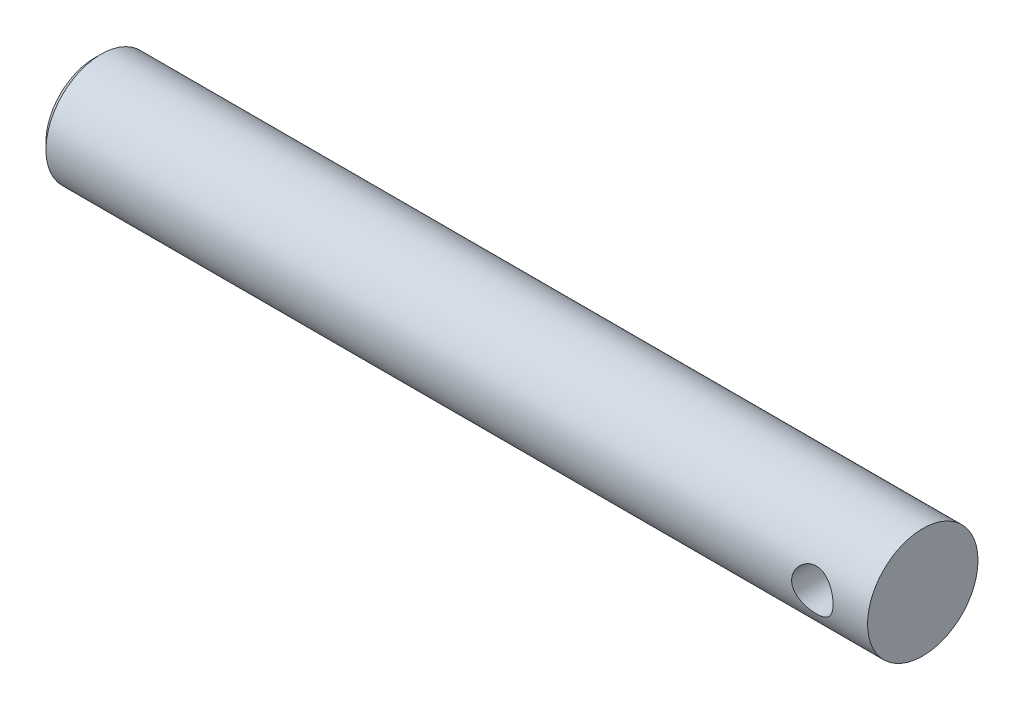
ISO-10303-21;
HEADER;
FILE_DESCRIPTION(('STEP AP214'),'2;1');
FILE_NAME('part.step','',(''),(''),'','','');
FILE_SCHEMA(('AUTOMOTIVE_DESIGN { 1 0 10303 214 1 1 1 1 }'));
ENDSEC;
DATA;
#1=APPLICATION_CONTEXT('core data for automotive mechanical design processes');
#2=APPLICATION_PROTOCOL_DEFINITION('international standard','automotive_design',2000,#1);
#3=PRODUCT_CONTEXT('',#1,'mechanical');
#4=PRODUCT('Part','Part','',(#3));
#5=PRODUCT_RELATED_PRODUCT_CATEGORY('part','',(#4));
#6=PRODUCT_DEFINITION_FORMATION('','',#4);
#7=PRODUCT_DEFINITION_CONTEXT('part definition',#1,'design');
#8=PRODUCT_DEFINITION('design','',#6,#7);
#9=PRODUCT_DEFINITION_SHAPE('','',#8);
#10=(LENGTH_UNIT() NAMED_UNIT(*) SI_UNIT(.MILLI.,.METRE.));
#11=(NAMED_UNIT(*) PLANE_ANGLE_UNIT() SI_UNIT($,.RADIAN.));
#12=(NAMED_UNIT(*) SI_UNIT($,.STERADIAN.) SOLID_ANGLE_UNIT());
#13=UNCERTAINTY_MEASURE_WITH_UNIT(LENGTH_MEASURE(1.E-05),#10,'distance_accuracy_value','');
#14=(GEOMETRIC_REPRESENTATION_CONTEXT(3) GLOBAL_UNCERTAINTY_ASSIGNED_CONTEXT((#13)) GLOBAL_UNIT_ASSIGNED_CONTEXT((#10,
#11,#12)) REPRESENTATION_CONTEXT('',''));
#15=CARTESIAN_POINT('',(0.,0.,0.));
#16=DIRECTION('',(0.,0.,1.));
#17=DIRECTION('',(1.,0.,0.));
#18=AXIS2_PLACEMENT_3D('',#15,#16,#17);
#19=CARTESIAN_POINT('',(95.25,0.,0.));
#20=DIRECTION('',(-1.,0.,0.));
#21=DIRECTION('',(0.,0.,1.));
#22=AXIS2_PLACEMENT_3D('',#19,#20,#21);
#23=CYLINDRICAL_SURFACE('',#22,6.35);
#24=CARTESIAN_POINT('',(0.762000000000013,0.,0.));
#25=DIRECTION('',(1.,0.,0.));
#26=DIRECTION('',(0.,0.,-1.));
#27=AXIS2_PLACEMENT_3D('',#24,#25,#26);
#28=CIRCLE('',#27,6.35);
#29=CARTESIAN_POINT('',(0.762000000000013,0.,-6.35));
#30=VERTEX_POINT('',#29);
#31=EDGE_CURVE('E50',#30,#30,#28,.T.);
#32=ORIENTED_EDGE('',*,*,#31,.T.);
#33=EDGE_LOOP('',(#32));
#34=FACE_BOUND('',#33,.T.);
#35=CARTESIAN_POINT('',(91.28125,0.,-6.35));
#36=CARTESIAN_POINT('',(91.2812546074062,0.128960656063842,-6.3500034521164));
#37=CARTESIAN_POINT('',(91.2707411306057,0.257889758828596,-6.34603727112054));
#38=CARTESIAN_POINT('',(91.229135240009,0.511894855609375,-6.33061179910997));
#39=CARTESIAN_POINT('',(91.198045790503,0.636971401930343,-6.31915358744214));
#40=CARTESIAN_POINT('',(91.1165421096873,0.879571496173019,-6.28997396421577));
#41=CARTESIAN_POINT('',(91.0661651545454,0.997109105857609,-6.27226463904736));
#42=CARTESIAN_POINT('',(90.9477060693374,1.2220564048794,-6.23234668827498));
#43=CARTESIAN_POINT('',(90.8796191904487,1.32946336719488,-6.21013685623732));
#44=CARTESIAN_POINT('',(90.7246526069249,1.53566243706025,-6.16245667066806));
#45=CARTESIAN_POINT('',(90.6371532086632,1.63396728411503,-6.1368940410141));
#46=CARTESIAN_POINT('',(90.4471609349791,1.81490019090553,-6.08584350633231));
#47=CARTESIAN_POINT('',(90.3446634872105,1.89752345220235,-6.06035562651864));
#48=CARTESIAN_POINT('',(90.1228235203069,2.04784646017877,-6.01126672105648));
#49=CARTESIAN_POINT('',(90.0029880681085,2.11485786698269,-5.98777455003049));
#50=CARTESIAN_POINT('',(89.7527282377575,2.2275585105536,-5.94677278126925));
#51=CARTESIAN_POINT('',(89.6223081134913,2.27325626375968,-5.92926079474211));
#52=CARTESIAN_POINT('',(89.3601896748401,2.3401088424036,-5.90318880358315));
#53=CARTESIAN_POINT('',(89.2287632514837,2.36219354234461,-5.89429104906955));
#54=CARTESIAN_POINT('',(88.9637918491848,2.38410045993992,-5.88546672569678));
#55=CARTESIAN_POINT('',(88.8302477679743,2.38393187174176,-5.88553645184146));
#56=CARTESIAN_POINT('',(88.5733408787244,2.36204807005904,-5.89434799715886));
#57=CARTESIAN_POINT('',(88.4498470616549,2.34162296008043,-5.90257056832905));
#58=CARTESIAN_POINT('',(88.2081878987316,2.28193866490974,-5.92589839169503));
#59=CARTESIAN_POINT('',(88.0900233582505,2.24267664340423,-5.94100468036945));
#60=CARTESIAN_POINT('',(87.8597476549814,2.14572450857897,-5.97671052227027));
#61=CARTESIAN_POINT('',(87.7477933157824,2.08769979870147,-5.99740859806213));
#62=CARTESIAN_POINT('',(87.5348361415743,1.95510267098283,-6.04193308596169));
#63=CARTESIAN_POINT('',(87.4338371056875,1.88052453982124,-6.06576057700738));
#64=CARTESIAN_POINT('',(87.2385166839542,1.71103576966898,-6.11581261688841));
#65=CARTESIAN_POINT('',(87.1451002828124,1.61509549213168,-6.14209064085877));
#66=CARTESIAN_POINT('',(86.9754134786483,1.4086087379252,-6.19270618460486));
#67=CARTESIAN_POINT('',(86.8991457108135,1.29806002055207,-6.21704340577199));
#68=CARTESIAN_POINT('',(86.7649229946633,1.06318595622547,-6.26151901759414));
#69=CARTESIAN_POINT('',(86.7072694648116,0.938674008228491,-6.2815866598714));
#70=CARTESIAN_POINT('',(86.6140276157213,0.680778500207775,-6.31473715344052));
#71=CARTESIAN_POINT('',(86.5784294962092,0.547398909717654,-6.3278231066712));
#72=CARTESIAN_POINT('',(86.5320488247772,0.283170698498504,-6.34499053624553));
#73=CARTESIAN_POINT('',(86.5200476123678,0.152564496055005,-6.34951373328277));
#74=CARTESIAN_POINT('',(86.5176529360589,-0.108858804467353,-6.3504110624895));
#75=CARTESIAN_POINT('',(86.5272546814971,-0.239675849361106,-6.34678700139145));
#76=CARTESIAN_POINT('',(86.566867192165,-0.492541002091955,-6.33208839264071));
#77=CARTESIAN_POINT('',(86.5960795756826,-0.614732908211651,-6.32130547652659));
#78=CARTESIAN_POINT('',(86.6730328901689,-0.852395035994594,-6.29366719883101));
#79=CARTESIAN_POINT('',(86.7207762309925,-0.967864381176714,-6.27681104747723));
#80=CARTESIAN_POINT('',(86.8349584297477,-1.19260582711238,-6.23807528747194));
#81=CARTESIAN_POINT('',(86.9019053951421,-1.30159614514801,-6.2160626283234));
#82=CARTESIAN_POINT('',(87.0520199887848,-1.50716092986602,-6.16944841108904));
#83=CARTESIAN_POINT('',(87.1351936054154,-1.60373079092935,-6.14484589877607));
#84=CARTESIAN_POINT('',(87.3210790438723,-1.78757389300697,-6.09398910566946));
#85=CARTESIAN_POINT('',(87.4246444651517,-1.87398269671165,-6.0677218069967));
#86=CARTESIAN_POINT('',(87.6453215732234,-2.02836541925647,-6.0178761999813));
#87=CARTESIAN_POINT('',(87.7624344750793,-2.09633768270549,-5.99429813321109));
#88=CARTESIAN_POINT('',(88.0078503790011,-2.2119871546141,-5.9525984234316));
#89=CARTESIAN_POINT('',(88.1361977841328,-2.25957900646984,-5.93449982021483));
#90=CARTESIAN_POINT('',(88.3999529998544,-2.33216265003688,-5.9063577721447));
#91=CARTESIAN_POINT('',(88.5353563874645,-2.35716842360038,-5.89630934428766));
#92=CARTESIAN_POINT('',(88.8000131532715,-2.3826207601782,-5.8860673298321));
#93=CARTESIAN_POINT('',(88.9291030528506,-2.38454138749642,-5.88528230680804));
#94=CARTESIAN_POINT('',(89.1856631895884,-2.36754536081029,-5.89213980233151));
#95=CARTESIAN_POINT('',(89.3131335791662,-2.34863068262072,-5.89978152177002));
#96=CARTESIAN_POINT('',(89.5588874724126,-2.29164857313009,-5.92213924766874));
#97=CARTESIAN_POINT('',(89.6773326246645,-2.25418329827482,-5.93663223035452));
#98=CARTESIAN_POINT('',(89.9063249947349,-2.16169393638122,-5.97092957922828));
#99=CARTESIAN_POINT('',(90.0168702073114,-2.106665410501,-5.99073528792403));
#100=CARTESIAN_POINT('',(90.233225028645,-1.97726420551819,-6.03471811697544));
#101=CARTESIAN_POINT('',(90.3384826399199,-1.90202872074779,-6.0590699627503));
#102=CARTESIAN_POINT('',(90.5353497280418,-1.73568496096226,-6.10879916727019));
#103=CARTESIAN_POINT('',(90.626954849974,-1.64457164120333,-6.13417684997243));
#104=CARTESIAN_POINT('',(90.7989706048672,-1.44316512989559,-6.18474799068186));
#105=CARTESIAN_POINT('',(90.8785072085776,-1.33210084768812,-6.20985716529773));
#106=CARTESIAN_POINT('',(91.0177609652515,-1.0973009918313,-6.25561541700536));
#107=CARTESIAN_POINT('',(91.0774765755315,-0.973564432868858,-6.2762641468935));
#108=CARTESIAN_POINT('',(91.1770732161142,-0.711198542678667,-6.31149189513105));
#109=CARTESIAN_POINT('',(91.2159832150555,-0.572156307796804,-6.3257693073889));
#110=CARTESIAN_POINT('',(91.2680625738741,-0.288727727100132,-6.34501909460094));
#111=CARTESIAN_POINT('',(91.2812448429861,-0.144344098479214,-6.34999613608798));
#112=CARTESIAN_POINT('',(91.28125,0.,-6.35));
#113=B_SPLINE_CURVE_WITH_KNOTS('',3,(#35,#36,#37,#38,#39,#40,#41,#42,#43,#44,#45,#46,#47,#48,
#49,#50,#51,#52,#53,#54,#55,#56,#57,#58,#59,#60,#61,#62,#63,#64,#65,#66,#67,#68,#69,#70,#71,#72,
#73,#74,#75,#76,#77,#78,#79,#80,#81,#82,#83,#84,#85,#86,#87,#88,#89,#90,#91,#92,#93,#94,#95,#96,
#97,#98,#99,#100,#101,#102,#103,#104,#105,#106,#107,#108,#109,#110,#111,#112),.UNSPECIFIED.,.T.,
.F.,(4,2,2,2,2,2,2,2,2,2,2,2,2,2,2,2,2,2,2,2,2,2,2,2,2,2,2,2,2,2,2,2,2,2,2,2,2,2,4),(0.,
0.38634955997739,0.772643472379607,1.15819454862654,1.54384911513007,1.94426869500062,
2.34481060319426,2.76060970771384,3.17624252596513,3.57482575636833,3.97324430901536,
4.34781872877956,4.72244956671187,5.10416823314393,5.4860188530651,5.89353268420603,
6.30110909424294,6.71498808266646,7.12868303271919,7.52038468672033,7.91199948569953,
8.28856670204098,8.66518290541447,9.05286514702116,9.44069073281542,9.85101724635859,
10.2613805903573,10.6734461842944,11.0852565149346,11.470620370249,11.8559476846038,
12.2295148860212,12.6031765756721,12.9964254911628,13.3897995792034,13.8044607332579,
14.219154153156,14.6518076761337,15.0842440535135),.UNSPECIFIED.);
#114=CARTESIAN_POINT('',(91.28125,0.,-6.35));
#115=VERTEX_POINT('',#114);
#116=EDGE_CURVE('E54',#115,#115,#113,.T.);
#117=ORIENTED_EDGE('',*,*,#116,.T.);
#118=EDGE_LOOP('',(#117));
#119=FACE_BOUND('',#118,.T.);
#120=CARTESIAN_POINT('',(91.28125,0.,6.35));
#121=CARTESIAN_POINT('',(91.2812546074062,-0.128960656063842,6.3500034521164));
#122=CARTESIAN_POINT('',(91.2707411306057,-0.257889758828596,6.34603727112054));
#123=CARTESIAN_POINT('',(91.229135240009,-0.511894855609375,6.33061179910997));
#124=CARTESIAN_POINT('',(91.198045790503,-0.636971401930343,6.31915358744214));
#125=CARTESIAN_POINT('',(91.1165421096873,-0.879571496173019,6.28997396421577));
#126=CARTESIAN_POINT('',(91.0661651545454,-0.997109105857609,6.27226463904736));
#127=CARTESIAN_POINT('',(90.9477060693374,-1.2220564048794,6.23234668827498));
#128=CARTESIAN_POINT('',(90.8796191904487,-1.32946336719488,6.21013685623732));
#129=CARTESIAN_POINT('',(90.7246526069249,-1.53566243706025,6.16245667066806));
#130=CARTESIAN_POINT('',(90.6371532086632,-1.63396728411503,6.1368940410141));
#131=CARTESIAN_POINT('',(90.4471609349791,-1.81490019090553,6.08584350633231));
#132=CARTESIAN_POINT('',(90.3446634872105,-1.89752345220235,6.06035562651864));
#133=CARTESIAN_POINT('',(90.1228235203069,-2.04784646017877,6.01126672105648));
#134=CARTESIAN_POINT('',(90.0029880681085,-2.11485786698269,5.98777455003049));
#135=CARTESIAN_POINT('',(89.7527282377575,-2.2275585105536,5.94677278126925));
#136=CARTESIAN_POINT('',(89.6223081134913,-2.27325626375968,5.92926079474211));
#137=CARTESIAN_POINT('',(89.3601896748401,-2.3401088424036,5.90318880358315));
#138=CARTESIAN_POINT('',(89.2287632514837,-2.36219354234461,5.89429104906955));
#139=CARTESIAN_POINT('',(88.9637918491848,-2.38410045993992,5.88546672569678));
#140=CARTESIAN_POINT('',(88.8302477679743,-2.38393187174176,5.88553645184146));
#141=CARTESIAN_POINT('',(88.5733408787244,-2.36204807005904,5.89434799715886));
#142=CARTESIAN_POINT('',(88.4498470616549,-2.34162296008043,5.90257056832905));
#143=CARTESIAN_POINT('',(88.2081878987316,-2.28193866490974,5.92589839169503));
#144=CARTESIAN_POINT('',(88.0900233582505,-2.24267664340423,5.94100468036945));
#145=CARTESIAN_POINT('',(87.8597476549814,-2.14572450857897,5.97671052227027));
#146=CARTESIAN_POINT('',(87.7477933157824,-2.08769979870147,5.99740859806213));
#147=CARTESIAN_POINT('',(87.5348361415743,-1.95510267098283,6.04193308596169));
#148=CARTESIAN_POINT('',(87.4338371056875,-1.88052453982124,6.06576057700738));
#149=CARTESIAN_POINT('',(87.2385166839542,-1.71103576966898,6.11581261688841));
#150=CARTESIAN_POINT('',(87.1451002828124,-1.61509549213168,6.14209064085877));
#151=CARTESIAN_POINT('',(86.9754134786483,-1.4086087379252,6.19270618460486));
#152=CARTESIAN_POINT('',(86.8991457108135,-1.29806002055207,6.21704340577199));
#153=CARTESIAN_POINT('',(86.7649229946633,-1.06318595622547,6.26151901759414));
#154=CARTESIAN_POINT('',(86.7072694648116,-0.938674008228491,6.2815866598714));
#155=CARTESIAN_POINT('',(86.6140276157213,-0.680778500207775,6.31473715344052));
#156=CARTESIAN_POINT('',(86.5784294962092,-0.547398909717654,6.3278231066712));
#157=CARTESIAN_POINT('',(86.5320488247772,-0.283170698498504,6.34499053624553));
#158=CARTESIAN_POINT('',(86.5200476123678,-0.152564496055005,6.34951373328277));
#159=CARTESIAN_POINT('',(86.5176529360589,0.108858804467353,6.3504110624895));
#160=CARTESIAN_POINT('',(86.5272546814971,0.239675849361106,6.34678700139145));
#161=CARTESIAN_POINT('',(86.566867192165,0.492541002091955,6.33208839264071));
#162=CARTESIAN_POINT('',(86.5960795756826,0.614732908211651,6.32130547652659));
#163=CARTESIAN_POINT('',(86.6730328901689,0.852395035994594,6.29366719883101));
#164=CARTESIAN_POINT('',(86.7207762309925,0.967864381176714,6.27681104747723));
#165=CARTESIAN_POINT('',(86.8349584297477,1.19260582711238,6.23807528747194));
#166=CARTESIAN_POINT('',(86.9019053951421,1.30159614514801,6.2160626283234));
#167=CARTESIAN_POINT('',(87.0520199887848,1.50716092986602,6.16944841108904));
#168=CARTESIAN_POINT('',(87.1351936054154,1.60373079092935,6.14484589877607));
#169=CARTESIAN_POINT('',(87.3210790438723,1.78757389300697,6.09398910566946));
#170=CARTESIAN_POINT('',(87.4246444651517,1.87398269671165,6.0677218069967));
#171=CARTESIAN_POINT('',(87.6453215732234,2.02836541925647,6.0178761999813));
#172=CARTESIAN_POINT('',(87.7624344750793,2.09633768270549,5.99429813321109));
#173=CARTESIAN_POINT('',(88.0078503790011,2.2119871546141,5.9525984234316));
#174=CARTESIAN_POINT('',(88.1361977841328,2.25957900646984,5.93449982021483));
#175=CARTESIAN_POINT('',(88.3999529998544,2.33216265003688,5.9063577721447));
#176=CARTESIAN_POINT('',(88.5353563874645,2.35716842360038,5.89630934428766));
#177=CARTESIAN_POINT('',(88.8000131532715,2.3826207601782,5.8860673298321));
#178=CARTESIAN_POINT('',(88.9291030528506,2.38454138749642,5.88528230680804));
#179=CARTESIAN_POINT('',(89.1856631895884,2.36754536081029,5.89213980233151));
#180=CARTESIAN_POINT('',(89.3131335791662,2.34863068262072,5.89978152177002));
#181=CARTESIAN_POINT('',(89.5588874724126,2.29164857313009,5.92213924766874));
#182=CARTESIAN_POINT('',(89.6773326246645,2.25418329827482,5.93663223035452));
#183=CARTESIAN_POINT('',(89.9063249947349,2.16169393638122,5.97092957922828));
#184=CARTESIAN_POINT('',(90.0168702073114,2.106665410501,5.99073528792403));
#185=CARTESIAN_POINT('',(90.233225028645,1.97726420551819,6.03471811697544));
#186=CARTESIAN_POINT('',(90.3384826399199,1.90202872074779,6.0590699627503));
#187=CARTESIAN_POINT('',(90.5353497280418,1.73568496096226,6.10879916727019));
#188=CARTESIAN_POINT('',(90.626954849974,1.64457164120333,6.13417684997243));
#189=CARTESIAN_POINT('',(90.7989706048672,1.44316512989559,6.18474799068186));
#190=CARTESIAN_POINT('',(90.8785072085776,1.33210084768812,6.20985716529773));
#191=CARTESIAN_POINT('',(91.0177609652515,1.0973009918313,6.25561541700536));
#192=CARTESIAN_POINT('',(91.0774765755315,0.973564432868858,6.2762641468935));
#193=CARTESIAN_POINT('',(91.1770732161142,0.711198542678667,6.31149189513105));
#194=CARTESIAN_POINT('',(91.2159832150555,0.572156307796804,6.3257693073889));
#195=CARTESIAN_POINT('',(91.2680625738741,0.288727727100132,6.34501909460094));
#196=CARTESIAN_POINT('',(91.2812448429861,0.144344098479214,6.34999613608798));
#197=CARTESIAN_POINT('',(91.28125,0.,6.35));
#198=B_SPLINE_CURVE_WITH_KNOTS('',3,(#120,#121,#122,#123,#124,#125,#126,#127,#128,#129,#130,
#131,#132,#133,#134,#135,#136,#137,#138,#139,#140,#141,#142,#143,#144,#145,#146,#147,#148,#149,
#150,#151,#152,#153,#154,#155,#156,#157,#158,#159,#160,#161,#162,#163,#164,#165,#166,#167,#168,
#169,#170,#171,#172,#173,#174,#175,#176,#177,#178,#179,#180,#181,#182,#183,#184,#185,#186,#187,
#188,#189,#190,#191,#192,#193,#194,#195,#196,#197),.UNSPECIFIED.,.T.,.F.,(4,2,2,2,2,2,2,2,2,2,2,
2,2,2,2,2,2,2,2,2,2,2,2,2,2,2,2,2,2,2,2,2,2,2,2,2,2,2,4),(0.,0.38634955997739,0.772643472379607,
1.15819454862654,1.54384911513007,1.94426869500062,2.34481060319426,2.76060970771384,
3.17624252596513,3.57482575636833,3.97324430901536,4.34781872877956,4.72244956671187,
5.10416823314393,5.4860188530651,5.89353268420603,6.30110909424294,6.71498808266646,
7.12868303271919,7.52038468672033,7.91199948569953,8.28856670204098,8.66518290541447,
9.05286514702116,9.44069073281542,9.85101724635859,10.2613805903573,10.6734461842944,
11.0852565149346,11.470620370249,11.8559476846038,12.2295148860212,12.6031765756721,
12.9964254911628,13.3897995792034,13.8044607332579,14.219154153156,14.6518076761337,
15.0842440535135),.UNSPECIFIED.);
#199=CARTESIAN_POINT('',(91.28125,0.,6.35));
#200=VERTEX_POINT('',#199);
#201=EDGE_CURVE('E58',#200,#200,#198,.T.);
#202=ORIENTED_EDGE('',*,*,#201,.T.);
#203=EDGE_LOOP('',(#202));
#204=FACE_BOUND('',#203,.T.);
#205=CARTESIAN_POINT('',(95.25,0.,0.));
#206=DIRECTION('',(1.,0.,0.));
#207=DIRECTION('',(0.,0.,-1.));
#208=AXIS2_PLACEMENT_3D('',#205,#206,#207);
#209=CIRCLE('',#208,6.35);
#210=CARTESIAN_POINT('',(95.25,0.,-6.35));
#211=VERTEX_POINT('',#210);
#212=EDGE_CURVE('E99',#211,#211,#209,.T.);
#213=ORIENTED_EDGE('',*,*,#212,.F.);
#214=EDGE_LOOP('',(#213));
#215=FACE_BOUND('',#214,.T.);
#216=ADVANCED_FACE('F43',(#34,#119,#204,#215),#23,.T.);
#217=CARTESIAN_POINT('',(95.25,0.,0.));
#218=DIRECTION('',(1.,0.,0.));
#219=DIRECTION('',(0.,0.,-1.));
#220=AXIS2_PLACEMENT_3D('',#217,#218,#219);
#221=PLANE('',#220);
#222=ORIENTED_EDGE('',*,*,#212,.T.);
#223=EDGE_LOOP('',(#222));
#224=FACE_BOUND('',#223,.T.);
#225=ADVANCED_FACE('F80',(#224),#221,.T.);
#226=CARTESIAN_POINT('',(0.,0.,0.));
#227=DIRECTION('',(1.,0.,0.));
#228=DIRECTION('',(0.,0.,-1.));
#229=AXIS2_PLACEMENT_3D('',#226,#227,#228);
#230=PLANE('',#229);
#231=CARTESIAN_POINT('',(0.,0.,0.));
#232=DIRECTION('',(1.,0.,0.));
#233=DIRECTION('',(0.,0.,-1.));
#234=AXIS2_PLACEMENT_3D('',#231,#232,#233);
#235=CIRCLE('',#234,5.58799999999999);
#236=CARTESIAN_POINT('',(0.,0.,-5.58799999999999));
#237=VERTEX_POINT('',#236);
#238=EDGE_CURVE('E10',#237,#237,#235,.F.);
#239=ORIENTED_EDGE('',*,*,#238,.T.);
#240=EDGE_LOOP('',(#239));
#241=FACE_BOUND('',#240,.T.);
#242=CARTESIAN_POINT('',(0.,0.,0.));
#243=DIRECTION('',(-1.,0.,0.));
#244=DIRECTION('',(0.,0.,1.));
#245=AXIS2_PLACEMENT_3D('',#242,#243,#244);
#246=CIRCLE('',#245,2.38125);
#247=CARTESIAN_POINT('',(0.,0.,2.38125));
#248=VERTEX_POINT('',#247);
#249=EDGE_CURVE('E102',#248,#248,#246,.T.);
#250=ORIENTED_EDGE('',*,*,#249,.F.);
#251=EDGE_LOOP('',(#250));
#252=FACE_BOUND('',#251,.T.);
#253=ADVANCED_FACE('F77',(#241,#252),#230,.F.);
#254=CARTESIAN_POINT('',(88.9,0.,-6.35));
#255=DIRECTION('',(0.,0.,1.));
#256=DIRECTION('',(1.,0.,0.));
#257=AXIS2_PLACEMENT_3D('',#254,#255,#256);
#258=CYLINDRICAL_SURFACE('',#257,2.38125000000001);
#259=ORIENTED_EDGE('',*,*,#201,.F.);
#260=EDGE_LOOP('',(#259));
#261=FACE_BOUND('',#260,.T.);
#262=ORIENTED_EDGE('',*,*,#116,.F.);
#263=EDGE_LOOP('',(#262));
#264=FACE_BOUND('',#263,.T.);
#265=ADVANCED_FACE('F71',(#261,#264),#258,.F.);
#266=CARTESIAN_POINT('',(25.4,0.,0.));
#267=DIRECTION('',(-1.,0.,0.));
#268=DIRECTION('',(0.,0.,1.));
#269=AXIS2_PLACEMENT_3D('',#266,#267,#268);
#270=CYLINDRICAL_SURFACE('',#269,2.38125);
#271=CARTESIAN_POINT('',(25.4,0.,0.));
#272=DIRECTION('',(-1.,0.,0.));
#273=DIRECTION('',(0.,0.,1.));
#274=AXIS2_PLACEMENT_3D('',#271,#272,#273);
#275=CIRCLE('',#274,2.38125);
#276=CARTESIAN_POINT('',(25.4,0.,2.38125));
#277=VERTEX_POINT('',#276);
#278=EDGE_CURVE('E100',#277,#277,#275,.T.);
#279=ORIENTED_EDGE('',*,*,#278,.F.);
#280=EDGE_LOOP('',(#279));
#281=FACE_BOUND('',#280,.T.);
#282=ORIENTED_EDGE('',*,*,#249,.T.);
#283=EDGE_LOOP('',(#282));
#284=FACE_BOUND('',#283,.T.);
#285=ADVANCED_FACE('F76',(#281,#284),#270,.F.);
#286=CARTESIAN_POINT('',(25.4,0.,0.));
#287=DIRECTION('',(-1.,0.,0.));
#288=DIRECTION('',(0.,0.,1.));
#289=AXIS2_PLACEMENT_3D('',#286,#287,#288);
#290=PLANE('',#289);
#291=ORIENTED_EDGE('',*,*,#278,.T.);
#292=EDGE_LOOP('',(#291));
#293=FACE_BOUND('',#292,.T.);
#294=ADVANCED_FACE('F109',(#293),#290,.T.);
#295=CARTESIAN_POINT('',(0.762000000000013,0.,0.));
#296=DIRECTION('',(1.,0.,0.));
#297=DIRECTION('',(0.,0.,-1.));
#298=AXIS2_PLACEMENT_3D('',#295,#296,#297);
#299=CONICAL_SURFACE('',#298,6.35,0.785398163397444);
#300=ORIENTED_EDGE('',*,*,#238,.F.);
#301=EDGE_LOOP('',(#300));
#302=FACE_BOUND('',#301,.T.);
#303=ORIENTED_EDGE('',*,*,#31,.F.);
#304=EDGE_LOOP('',(#303));
#305=FACE_BOUND('',#304,.T.);
#306=ADVANCED_FACE('F45',(#302,#305),#299,.T.);
#307=CLOSED_SHELL('',(#216,#225,#253,#265,#285,#294,#306));
#308=MANIFOLD_SOLID_BREP('B2',#307);
#309=ADVANCED_BREP_SHAPE_REPRESENTATION('',(#18,#308),#14);
#310=SHAPE_DEFINITION_REPRESENTATION(#9,#309);
ENDSEC;
END-ISO-10303-21;
